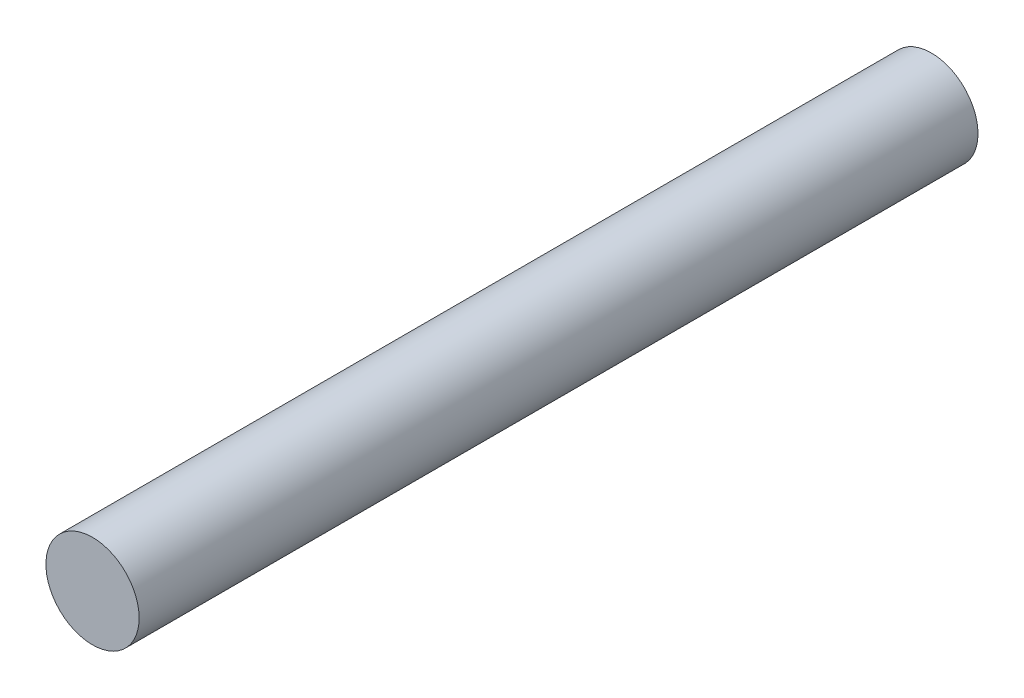
ISO-10303-21;
HEADER;
FILE_DESCRIPTION(('STEP AP214'),'2;1');
FILE_NAME('part.step','',(''),(''),'','','');
FILE_SCHEMA(('AUTOMOTIVE_DESIGN { 1 0 10303 214 1 1 1 1 }'));
ENDSEC;
DATA;
#1=APPLICATION_CONTEXT('core data for automotive mechanical design processes');
#2=APPLICATION_PROTOCOL_DEFINITION('international standard','automotive_design',2000,#1);
#3=PRODUCT_CONTEXT('',#1,'mechanical');
#4=PRODUCT('Part','Part','',(#3));
#5=PRODUCT_RELATED_PRODUCT_CATEGORY('part','',(#4));
#6=PRODUCT_DEFINITION_FORMATION('','',#4);
#7=PRODUCT_DEFINITION_CONTEXT('part definition',#1,'design');
#8=PRODUCT_DEFINITION('design','',#6,#7);
#9=PRODUCT_DEFINITION_SHAPE('','',#8);
#10=(LENGTH_UNIT() NAMED_UNIT(*) SI_UNIT(.MILLI.,.METRE.));
#11=(NAMED_UNIT(*) PLANE_ANGLE_UNIT() SI_UNIT($,.RADIAN.));
#12=(NAMED_UNIT(*) SI_UNIT($,.STERADIAN.) SOLID_ANGLE_UNIT());
#13=UNCERTAINTY_MEASURE_WITH_UNIT(LENGTH_MEASURE(1.E-05),#10,'distance_accuracy_value','');
#14=(GEOMETRIC_REPRESENTATION_CONTEXT(3) GLOBAL_UNCERTAINTY_ASSIGNED_CONTEXT((#13)) GLOBAL_UNIT_ASSIGNED_CONTEXT((#10,
#11,#12)) REPRESENTATION_CONTEXT('',''));
#15=CARTESIAN_POINT('',(0.,0.,0.));
#16=DIRECTION('',(0.,0.,1.));
#17=DIRECTION('',(1.,0.,0.));
#18=AXIS2_PLACEMENT_3D('',#15,#16,#17);
#19=CARTESIAN_POINT('',(0.,0.,-45.));
#20=DIRECTION('',(0.,0.,1.));
#21=DIRECTION('',(1.,0.,0.));
#22=AXIS2_PLACEMENT_3D('',#19,#20,#21);
#23=CYLINDRICAL_SURFACE('',#22,2.5);
#24=CARTESIAN_POINT('',(0.,0.,-45.));
#25=DIRECTION('',(0.,0.,1.));
#26=DIRECTION('',(1.,0.,0.));
#27=AXIS2_PLACEMENT_3D('',#24,#25,#26);
#28=CIRCLE('',#27,2.5);
#29=CARTESIAN_POINT('',(2.5,0.,-45.));
#30=VERTEX_POINT('',#29);
#31=EDGE_CURVE('E10',#30,#30,#28,.T.);
#32=ORIENTED_EDGE('',*,*,#31,.T.);
#33=EDGE_LOOP('',(#32));
#34=FACE_BOUND('',#33,.T.);
#35=CARTESIAN_POINT('',(0.,0.,0.));
#36=DIRECTION('',(0.,0.,1.));
#37=DIRECTION('',(1.,0.,0.));
#38=AXIS2_PLACEMENT_3D('',#35,#36,#37);
#39=CIRCLE('',#38,2.5);
#40=CARTESIAN_POINT('',(2.5,0.,0.));
#41=VERTEX_POINT('',#40);
#42=EDGE_CURVE('E34',#41,#41,#39,.T.);
#43=ORIENTED_EDGE('',*,*,#42,.F.);
#44=EDGE_LOOP('',(#43));
#45=FACE_BOUND('',#44,.T.);
#46=ADVANCED_FACE('F31',(#34,#45),#23,.T.);
#47=CARTESIAN_POINT('',(0.,0.,-45.));
#48=DIRECTION('',(0.,0.,1.));
#49=DIRECTION('',(1.,0.,0.));
#50=AXIS2_PLACEMENT_3D('',#47,#48,#49);
#51=PLANE('',#50);
#52=ORIENTED_EDGE('',*,*,#31,.F.);
#53=EDGE_LOOP('',(#52));
#54=FACE_BOUND('',#53,.T.);
#55=ADVANCED_FACE('F46',(#54),#51,.F.);
#56=CARTESIAN_POINT('',(0.,0.,0.));
#57=DIRECTION('',(0.,0.,1.));
#58=DIRECTION('',(1.,0.,0.));
#59=AXIS2_PLACEMENT_3D('',#56,#57,#58);
#60=PLANE('',#59);
#61=ORIENTED_EDGE('',*,*,#42,.T.);
#62=EDGE_LOOP('',(#61));
#63=FACE_BOUND('',#62,.T.);
#64=ADVANCED_FACE('F43',(#63),#60,.T.);
#65=CLOSED_SHELL('',(#46,#55,#64));
#66=MANIFOLD_SOLID_BREP('B2',#65);
#67=ADVANCED_BREP_SHAPE_REPRESENTATION('',(#18,#66),#14);
#68=SHAPE_DEFINITION_REPRESENTATION(#9,#67);
ENDSEC;
END-ISO-10303-21;
